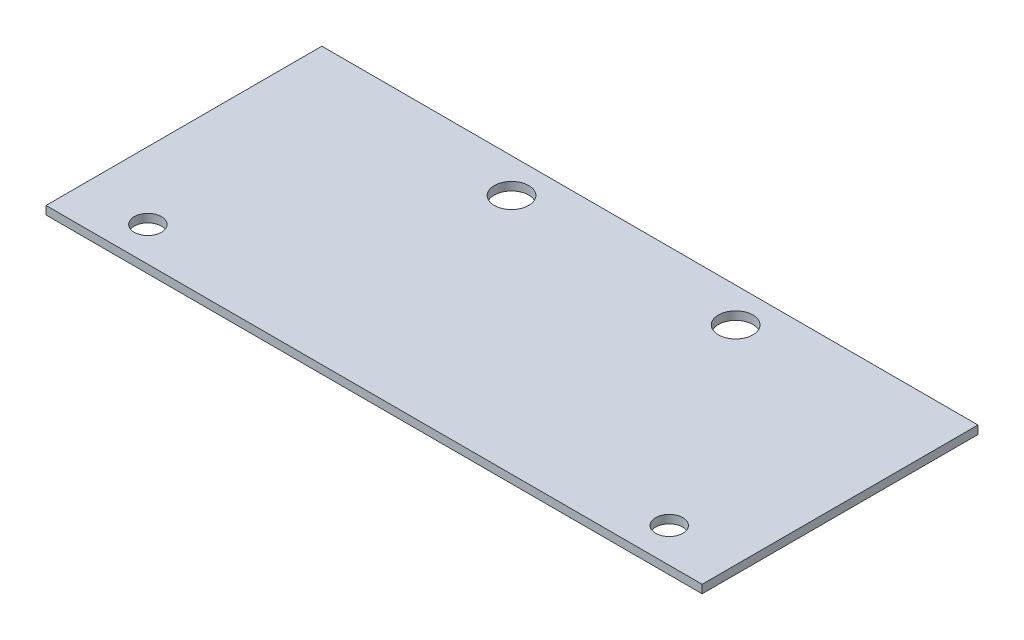
ISO-10303-21;
HEADER;
FILE_DESCRIPTION(('STEP AP214'),'2;1');
FILE_NAME('part.step','',(''),(''),'','','');
FILE_SCHEMA(('AUTOMOTIVE_DESIGN { 1 0 10303 214 1 1 1 1 }'));
ENDSEC;
DATA;
#1=APPLICATION_CONTEXT('core data for automotive mechanical design processes');
#2=APPLICATION_PROTOCOL_DEFINITION('international standard','automotive_design',2000,#1);
#3=PRODUCT_CONTEXT('',#1,'mechanical');
#4=PRODUCT('Part','Part','',(#3));
#5=PRODUCT_RELATED_PRODUCT_CATEGORY('part','',(#4));
#6=PRODUCT_DEFINITION_FORMATION('','',#4);
#7=PRODUCT_DEFINITION_CONTEXT('part definition',#1,'design');
#8=PRODUCT_DEFINITION('design','',#6,#7);
#9=PRODUCT_DEFINITION_SHAPE('','',#8);
#10=(LENGTH_UNIT() NAMED_UNIT(*) SI_UNIT(.MILLI.,.METRE.));
#11=(NAMED_UNIT(*) PLANE_ANGLE_UNIT() SI_UNIT($,.RADIAN.));
#12=(NAMED_UNIT(*) SI_UNIT($,.STERADIAN.) SOLID_ANGLE_UNIT());
#13=UNCERTAINTY_MEASURE_WITH_UNIT(LENGTH_MEASURE(1.E-05),#10,'distance_accuracy_value','');
#14=(GEOMETRIC_REPRESENTATION_CONTEXT(3) GLOBAL_UNCERTAINTY_ASSIGNED_CONTEXT((#13)) GLOBAL_UNIT_ASSIGNED_CONTEXT((#10,
#11,#12)) REPRESENTATION_CONTEXT('',''));
#15=CARTESIAN_POINT('',(0.,0.,0.));
#16=DIRECTION('',(0.,0.,1.));
#17=DIRECTION('',(1.,0.,0.));
#18=AXIS2_PLACEMENT_3D('',#15,#16,#17);
#19=CARTESIAN_POINT('',(-50.2215900326514,1.524,-41.4808605632417));
#20=DIRECTION('',(1.,0.,0.));
#21=DIRECTION('',(0.,0.,-1.));
#22=AXIS2_PLACEMENT_3D('',#19,#20,#21);
#23=PLANE('',#22);
#24=DIRECTION('',(0.,0.,1.));
#25=VECTOR('',#24,1.);
#26=CARTESIAN_POINT('',(-50.2215900326514,0.,-41.4808605632417));
#27=LINE('',#26,#25);
#28=CARTESIAN_POINT('',(-50.2215900326514,0.,-41.4808605632417));
#29=VERTEX_POINT('',#28);
#30=CARTESIAN_POINT('',(-50.2215900326514,0.,9.31913943675831));
#31=VERTEX_POINT('',#30);
#32=EDGE_CURVE('E114',#29,#31,#27,.T.);
#33=ORIENTED_EDGE('',*,*,#32,.T.);
#34=DIRECTION('',(0.,-1.,0.));
#35=VECTOR('',#34,1.);
#36=CARTESIAN_POINT('',(-50.2215900326514,1.524,9.31913943675831));
#37=LINE('',#36,#35);
#38=CARTESIAN_POINT('',(-50.2215900326514,1.524,9.31913943675831));
#39=VERTEX_POINT('',#38);
#40=EDGE_CURVE('E11',#39,#31,#37,.T.);
#41=ORIENTED_EDGE('',*,*,#40,.F.);
#42=DIRECTION('',(0.,0.,1.));
#43=VECTOR('',#42,1.);
#44=CARTESIAN_POINT('',(-50.2215900326514,1.524,-41.4808605632417));
#45=LINE('',#44,#43);
#46=CARTESIAN_POINT('',(-50.2215900326514,1.524,-41.4808605632417));
#47=VERTEX_POINT('',#46);
#48=EDGE_CURVE('E96',#47,#39,#45,.T.);
#49=ORIENTED_EDGE('',*,*,#48,.F.);
#50=DIRECTION('',(0.,-1.,0.));
#51=VECTOR('',#50,1.);
#52=CARTESIAN_POINT('',(-50.2215900326514,1.524,-41.4808605632417));
#53=LINE('',#52,#51);
#54=EDGE_CURVE('E110',#47,#29,#53,.T.);
#55=ORIENTED_EDGE('',*,*,#54,.T.);
#56=EDGE_LOOP('',(#33,#41,#49,#55));
#57=FACE_BOUND('',#56,.T.);
#58=ADVANCED_FACE('F45',(#57),#23,.F.);
#59=CARTESIAN_POINT('',(-50.2215900326514,1.524,9.31913943675831));
#60=DIRECTION('',(0.,0.,-1.));
#61=DIRECTION('',(-1.,0.,0.));
#62=AXIS2_PLACEMENT_3D('',#59,#60,#61);
#63=PLANE('',#62);
#64=DIRECTION('',(1.,0.,0.));
#65=VECTOR('',#64,1.);
#66=CARTESIAN_POINT('',(-50.2215900326514,0.,9.31913943675831));
#67=LINE('',#66,#65);
#68=CARTESIAN_POINT('',(70.6062099673486,0.,9.31913943675831));
#69=VERTEX_POINT('',#68);
#70=EDGE_CURVE('E102',#31,#69,#67,.T.);
#71=ORIENTED_EDGE('',*,*,#70,.T.);
#72=DIRECTION('',(0.,-1.,0.));
#73=VECTOR('',#72,1.);
#74=CARTESIAN_POINT('',(70.6062099673486,1.524,9.31913943675831));
#75=LINE('',#74,#73);
#76=CARTESIAN_POINT('',(70.6062099673486,1.524,9.31913943675831));
#77=VERTEX_POINT('',#76);
#78=EDGE_CURVE('E54',#77,#69,#75,.T.);
#79=ORIENTED_EDGE('',*,*,#78,.F.);
#80=DIRECTION('',(1.,0.,0.));
#81=VECTOR('',#80,1.);
#82=CARTESIAN_POINT('',(-50.2215900326514,1.524,9.31913943675831));
#83=LINE('',#82,#81);
#84=EDGE_CURVE('E90',#39,#77,#83,.T.);
#85=ORIENTED_EDGE('',*,*,#84,.F.);
#86=ORIENTED_EDGE('',*,*,#40,.T.);
#87=EDGE_LOOP('',(#71,#79,#85,#86));
#88=FACE_BOUND('',#87,.T.);
#89=ADVANCED_FACE('F101',(#88),#63,.F.);
#90=CARTESIAN_POINT('',(70.6062099673486,1.524,9.31913943675831));
#91=DIRECTION('',(-1.,0.,0.));
#92=DIRECTION('',(0.,0.,1.));
#93=AXIS2_PLACEMENT_3D('',#90,#91,#92);
#94=PLANE('',#93);
#95=DIRECTION('',(0.,0.,-1.));
#96=VECTOR('',#95,1.);
#97=CARTESIAN_POINT('',(70.6062099673486,0.,9.31913943675831));
#98=LINE('',#97,#96);
#99=CARTESIAN_POINT('',(70.6062099673486,0.,-41.4808605632417));
#100=VERTEX_POINT('',#99);
#101=EDGE_CURVE('E121',#69,#100,#98,.T.);
#102=ORIENTED_EDGE('',*,*,#101,.T.);
#103=DIRECTION('',(0.,-1.,0.));
#104=VECTOR('',#103,1.);
#105=CARTESIAN_POINT('',(70.6062099673486,1.524,-41.4808605632417));
#106=LINE('',#105,#104);
#107=CARTESIAN_POINT('',(70.6062099673486,1.524,-41.4808605632417));
#108=VERTEX_POINT('',#107);
#109=EDGE_CURVE('E105',#108,#100,#106,.T.);
#110=ORIENTED_EDGE('',*,*,#109,.F.);
#111=DIRECTION('',(0.,0.,-1.));
#112=VECTOR('',#111,1.);
#113=CARTESIAN_POINT('',(70.6062099673486,1.524,9.31913943675831));
#114=LINE('',#113,#112);
#115=EDGE_CURVE('E93',#77,#108,#114,.T.);
#116=ORIENTED_EDGE('',*,*,#115,.F.);
#117=ORIENTED_EDGE('',*,*,#78,.T.);
#118=EDGE_LOOP('',(#102,#110,#116,#117));
#119=FACE_BOUND('',#118,.T.);
#120=ADVANCED_FACE('F106',(#119),#94,.F.);
#121=CARTESIAN_POINT('',(-15.1695900326514,1.524,-41.4808605632417));
#122=DIRECTION('',(0.,0.,1.));
#123=DIRECTION('',(1.,0.,0.));
#124=AXIS2_PLACEMENT_3D('',#121,#122,#123);
#125=PLANE('',#124);
#126=DIRECTION('',(-1.,0.,0.));
#127=VECTOR('',#126,1.);
#128=CARTESIAN_POINT('',(-15.1695900326514,0.,-41.4808605632417));
#129=LINE('',#128,#127);
#130=EDGE_CURVE('E79',#100,#29,#129,.T.);
#131=ORIENTED_EDGE('',*,*,#130,.T.);
#132=ORIENTED_EDGE('',*,*,#54,.F.);
#133=DIRECTION('',(-1.,0.,0.));
#134=VECTOR('',#133,1.);
#135=CARTESIAN_POINT('',(70.6062099673486,1.524,-41.4808605632417));
#136=LINE('',#135,#134);
#137=EDGE_CURVE('E62',#108,#47,#136,.T.);
#138=ORIENTED_EDGE('',*,*,#137,.F.);
#139=ORIENTED_EDGE('',*,*,#109,.T.);
#140=EDGE_LOOP('',(#131,#132,#138,#139));
#141=FACE_BOUND('',#140,.T.);
#142=ADVANCED_FACE('F129',(#141),#125,.F.);
#143=CARTESIAN_POINT('',(0.,1.524,0.));
#144=DIRECTION('',(0.,1.,0.));
#145=DIRECTION('',(0.,0.,1.));
#146=AXIS2_PLACEMENT_3D('',#143,#144,#145);
#147=PLANE('',#146);
#148=CARTESIAN_POINT('',(-37.8136900326514,1.524,2.96913943675831));
#149=DIRECTION('',(0.,1.,0.));
#150=DIRECTION('',(0.,0.,1.));
#151=AXIS2_PLACEMENT_3D('',#148,#149,#150);
#152=CIRCLE('',#151,2.5019);
#153=CARTESIAN_POINT('',(-37.8136900326514,1.524,5.4710394367583));
#154=VERTEX_POINT('',#153);
#155=EDGE_CURVE('E157',#154,#154,#152,.T.);
#156=ORIENTED_EDGE('',*,*,#155,.F.);
#157=EDGE_LOOP('',(#156));
#158=FACE_BOUND('',#157,.T.);
#159=CARTESIAN_POINT('',(58.1983099673486,1.524,2.96913943675831));
#160=DIRECTION('',(0.,1.,0.));
#161=DIRECTION('',(0.,0.,1.));
#162=AXIS2_PLACEMENT_3D('',#159,#160,#161);
#163=CIRCLE('',#162,2.5019);
#164=CARTESIAN_POINT('',(58.1983099673486,1.524,5.4710394367583));
#165=VERTEX_POINT('',#164);
#166=EDGE_CURVE('E153',#165,#165,#163,.T.);
#167=ORIENTED_EDGE('',*,*,#166,.F.);
#168=EDGE_LOOP('',(#167));
#169=FACE_BOUND('',#168,.T.);
#170=CARTESIAN_POINT('',(32.3284099673486,1.524,-35.1308605632417));
#171=DIRECTION('',(0.,1.,0.));
#172=DIRECTION('',(0.,0.,1.));
#173=AXIS2_PLACEMENT_3D('',#170,#171,#172);
#174=CIRCLE('',#173,3.175);
#175=CARTESIAN_POINT('',(32.3284099673486,1.524,-31.9558605632417));
#176=VERTEX_POINT('',#175);
#177=EDGE_CURVE('E145',#176,#176,#174,.T.);
#178=ORIENTED_EDGE('',*,*,#177,.F.);
#179=EDGE_LOOP('',(#178));
#180=FACE_BOUND('',#179,.T.);
#181=CARTESIAN_POINT('',(-8.9465900326514,1.524,-35.1308605632417));
#182=DIRECTION('',(0.,1.,0.));
#183=DIRECTION('',(0.,0.,1.));
#184=AXIS2_PLACEMENT_3D('',#181,#182,#183);
#185=CIRCLE('',#184,3.175);
#186=CARTESIAN_POINT('',(-8.9465900326514,1.524,-31.9558605632417));
#187=VERTEX_POINT('',#186);
#188=EDGE_CURVE('E137',#187,#187,#185,.T.);
#189=ORIENTED_EDGE('',*,*,#188,.F.);
#190=EDGE_LOOP('',(#189));
#191=FACE_BOUND('',#190,.T.);
#192=ORIENTED_EDGE('',*,*,#48,.T.);
#193=ORIENTED_EDGE('',*,*,#84,.T.);
#194=ORIENTED_EDGE('',*,*,#115,.T.);
#195=ORIENTED_EDGE('',*,*,#137,.T.);
#196=EDGE_LOOP('',(#192,#193,#194,#195));
#197=FACE_BOUND('',#196,.T.);
#198=ADVANCED_FACE('F91',(#158,#169,#180,#191,#197),#147,.T.);
#199=CARTESIAN_POINT('',(0.,0.,0.));
#200=DIRECTION('',(0.,1.,0.));
#201=DIRECTION('',(0.,0.,1.));
#202=AXIS2_PLACEMENT_3D('',#199,#200,#201);
#203=PLANE('',#202);
#204=CARTESIAN_POINT('',(-37.8136900326514,0.,2.96913943675831));
#205=DIRECTION('',(0.,1.,0.));
#206=DIRECTION('',(0.,0.,1.));
#207=AXIS2_PLACEMENT_3D('',#204,#205,#206);
#208=CIRCLE('',#207,2.5019);
#209=CARTESIAN_POINT('',(-37.8136900326514,0.,5.4710394367583));
#210=VERTEX_POINT('',#209);
#211=EDGE_CURVE('E118',#210,#210,#208,.T.);
#212=ORIENTED_EDGE('',*,*,#211,.T.);
#213=EDGE_LOOP('',(#212));
#214=FACE_BOUND('',#213,.T.);
#215=CARTESIAN_POINT('',(58.1983099673486,0.,2.96913943675831));
#216=DIRECTION('',(0.,1.,0.));
#217=DIRECTION('',(0.,0.,1.));
#218=AXIS2_PLACEMENT_3D('',#215,#216,#217);
#219=CIRCLE('',#218,2.5019);
#220=CARTESIAN_POINT('',(58.1983099673486,0.,5.4710394367583));
#221=VERTEX_POINT('',#220);
#222=EDGE_CURVE('E149',#221,#221,#219,.T.);
#223=ORIENTED_EDGE('',*,*,#222,.T.);
#224=EDGE_LOOP('',(#223));
#225=FACE_BOUND('',#224,.T.);
#226=CARTESIAN_POINT('',(32.3284099673486,0.,-35.1308605632417));
#227=DIRECTION('',(0.,1.,0.));
#228=DIRECTION('',(0.,0.,1.));
#229=AXIS2_PLACEMENT_3D('',#226,#227,#228);
#230=CIRCLE('',#229,3.175);
#231=CARTESIAN_POINT('',(32.3284099673486,0.,-31.9558605632417));
#232=VERTEX_POINT('',#231);
#233=EDGE_CURVE('E141',#232,#232,#230,.T.);
#234=ORIENTED_EDGE('',*,*,#233,.T.);
#235=EDGE_LOOP('',(#234));
#236=FACE_BOUND('',#235,.T.);
#237=CARTESIAN_POINT('',(-8.9465900326514,0.,-35.1308605632417));
#238=DIRECTION('',(0.,1.,0.));
#239=DIRECTION('',(0.,0.,1.));
#240=AXIS2_PLACEMENT_3D('',#237,#238,#239);
#241=CIRCLE('',#240,3.175);
#242=CARTESIAN_POINT('',(-8.9465900326514,0.,-31.9558605632417));
#243=VERTEX_POINT('',#242);
#244=EDGE_CURVE('E133',#243,#243,#241,.T.);
#245=ORIENTED_EDGE('',*,*,#244,.T.);
#246=EDGE_LOOP('',(#245));
#247=FACE_BOUND('',#246,.T.);
#248=ORIENTED_EDGE('',*,*,#32,.F.);
#249=ORIENTED_EDGE('',*,*,#130,.F.);
#250=ORIENTED_EDGE('',*,*,#101,.F.);
#251=ORIENTED_EDGE('',*,*,#70,.F.);
#252=EDGE_LOOP('',(#248,#249,#250,#251));
#253=FACE_BOUND('',#252,.T.);
#254=ADVANCED_FACE('F165',(#214,#225,#236,#247,#253),#203,.F.);
#255=CARTESIAN_POINT('',(-8.9465900326514,0.,-35.1308605632417));
#256=DIRECTION('',(0.,1.,0.));
#257=DIRECTION('',(0.,0.,1.));
#258=AXIS2_PLACEMENT_3D('',#255,#256,#257);
#259=CYLINDRICAL_SURFACE('',#258,3.175);
#260=ORIENTED_EDGE('',*,*,#244,.F.);
#261=EDGE_LOOP('',(#260));
#262=FACE_BOUND('',#261,.T.);
#263=ORIENTED_EDGE('',*,*,#188,.T.);
#264=EDGE_LOOP('',(#263));
#265=FACE_BOUND('',#264,.T.);
#266=ADVANCED_FACE('F184',(#262,#265),#259,.F.);
#267=CARTESIAN_POINT('',(32.3284099673486,0.,-35.1308605632417));
#268=DIRECTION('',(0.,1.,0.));
#269=DIRECTION('',(0.,0.,1.));
#270=AXIS2_PLACEMENT_3D('',#267,#268,#269);
#271=CYLINDRICAL_SURFACE('',#270,3.175);
#272=ORIENTED_EDGE('',*,*,#233,.F.);
#273=EDGE_LOOP('',(#272));
#274=FACE_BOUND('',#273,.T.);
#275=ORIENTED_EDGE('',*,*,#177,.T.);
#276=EDGE_LOOP('',(#275));
#277=FACE_BOUND('',#276,.T.);
#278=ADVANCED_FACE('F186',(#274,#277),#271,.F.);
#279=CARTESIAN_POINT('',(58.1983099673486,0.,2.96913943675831));
#280=DIRECTION('',(0.,1.,0.));
#281=DIRECTION('',(0.,0.,1.));
#282=AXIS2_PLACEMENT_3D('',#279,#280,#281);
#283=CYLINDRICAL_SURFACE('',#282,2.5019);
#284=ORIENTED_EDGE('',*,*,#222,.F.);
#285=EDGE_LOOP('',(#284));
#286=FACE_BOUND('',#285,.T.);
#287=ORIENTED_EDGE('',*,*,#166,.T.);
#288=EDGE_LOOP('',(#287));
#289=FACE_BOUND('',#288,.T.);
#290=ADVANCED_FACE('F171',(#286,#289),#283,.F.);
#291=CARTESIAN_POINT('',(-37.8136900326514,0.,2.96913943675831));
#292=DIRECTION('',(0.,1.,0.));
#293=DIRECTION('',(0.,0.,1.));
#294=AXIS2_PLACEMENT_3D('',#291,#292,#293);
#295=CYLINDRICAL_SURFACE('',#294,2.5019);
#296=ORIENTED_EDGE('',*,*,#211,.F.);
#297=EDGE_LOOP('',(#296));
#298=FACE_BOUND('',#297,.T.);
#299=ORIENTED_EDGE('',*,*,#155,.T.);
#300=EDGE_LOOP('',(#299));
#301=FACE_BOUND('',#300,.T.);
#302=ADVANCED_FACE('F168',(#298,#301),#295,.F.);
#303=CLOSED_SHELL('',(#58,#89,#120,#142,#198,#254,#266,#278,#290,#302));
#304=MANIFOLD_SOLID_BREP('B2',#303);
#305=ADVANCED_BREP_SHAPE_REPRESENTATION('',(#18,#304),#14);
#306=SHAPE_DEFINITION_REPRESENTATION(#9,#305);
ENDSEC;
END-ISO-10303-21;
